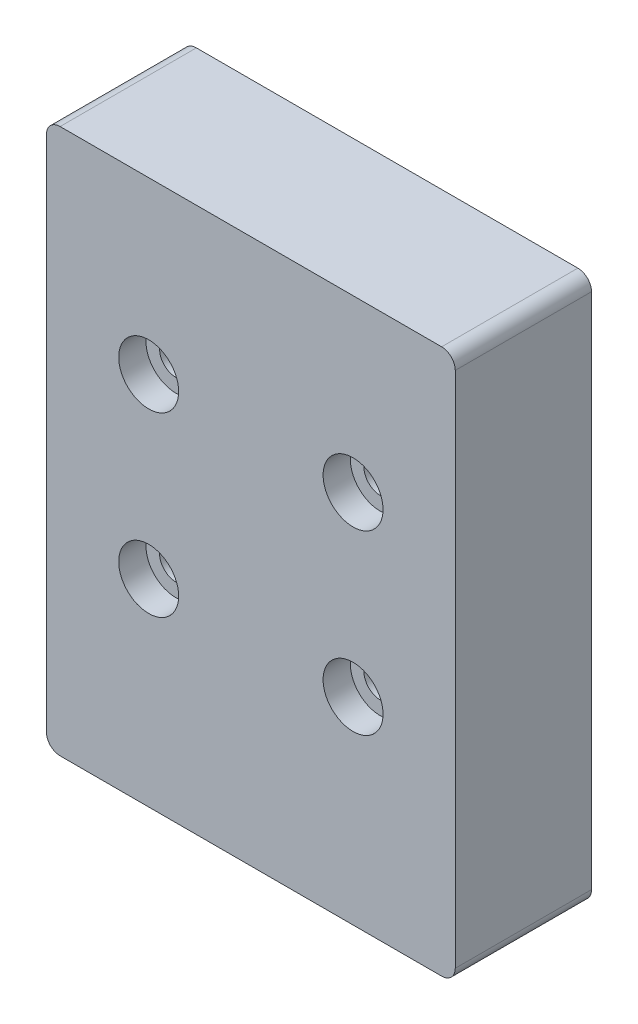
ISO-10303-21;
HEADER;
FILE_DESCRIPTION(('STEP AP214'),'2;1');
FILE_NAME('part.step','',(''),(''),'','','');
FILE_SCHEMA(('AUTOMOTIVE_DESIGN { 1 0 10303 214 1 1 1 1 }'));
ENDSEC;
DATA;
#1=APPLICATION_CONTEXT('core data for automotive mechanical design processes');
#2=APPLICATION_PROTOCOL_DEFINITION('international standard','automotive_design',2000,#1);
#3=PRODUCT_CONTEXT('',#1,'mechanical');
#4=PRODUCT('Part','Part','',(#3));
#5=PRODUCT_RELATED_PRODUCT_CATEGORY('part','',(#4));
#6=PRODUCT_DEFINITION_FORMATION('','',#4);
#7=PRODUCT_DEFINITION_CONTEXT('part definition',#1,'design');
#8=PRODUCT_DEFINITION('design','',#6,#7);
#9=PRODUCT_DEFINITION_SHAPE('','',#8);
#10=(LENGTH_UNIT() NAMED_UNIT(*) SI_UNIT(.MILLI.,.METRE.));
#11=(NAMED_UNIT(*) PLANE_ANGLE_UNIT() SI_UNIT($,.RADIAN.));
#12=(NAMED_UNIT(*) SI_UNIT($,.STERADIAN.) SOLID_ANGLE_UNIT());
#13=UNCERTAINTY_MEASURE_WITH_UNIT(LENGTH_MEASURE(1.E-05),#10,'distance_accuracy_value','');
#14=(GEOMETRIC_REPRESENTATION_CONTEXT(3) GLOBAL_UNCERTAINTY_ASSIGNED_CONTEXT((#13)) GLOBAL_UNIT_ASSIGNED_CONTEXT((#10,
#11,#12)) REPRESENTATION_CONTEXT('',''));
#15=CARTESIAN_POINT('',(0.,0.,0.));
#16=DIRECTION('',(0.,0.,1.));
#17=DIRECTION('',(1.,0.,0.));
#18=AXIS2_PLACEMENT_3D('',#15,#16,#17);
#19=CARTESIAN_POINT('',(15.,-20.,5.));
#20=DIRECTION('',(-1.,0.,0.));
#21=DIRECTION('',(0.,0.,1.));
#22=AXIS2_PLACEMENT_3D('',#19,#20,#21);
#23=PLANE('',#22);
#24=DIRECTION('',(0.,1.,0.));
#25=VECTOR('',#24,1.);
#26=CARTESIAN_POINT('',(15.,-20.,-5.));
#27=LINE('',#26,#25);
#28=CARTESIAN_POINT('',(15.,-19.,-5.));
#29=VERTEX_POINT('',#28);
#30=CARTESIAN_POINT('',(15.,19.,-5.));
#31=VERTEX_POINT('',#30);
#32=EDGE_CURVE('E126',#29,#31,#27,.T.);
#33=ORIENTED_EDGE('',*,*,#32,.T.);
#34=DIRECTION('',(0.,0.,-1.));
#35=VECTOR('',#34,1.);
#36=CARTESIAN_POINT('',(15.,19.,5.));
#37=LINE('',#36,#35);
#38=CARTESIAN_POINT('',(15.,19.,5.));
#39=VERTEX_POINT('',#38);
#40=EDGE_CURVE('E104',#31,#39,#37,.F.);
#41=ORIENTED_EDGE('',*,*,#40,.T.);
#42=DIRECTION('',(0.,1.,0.));
#43=VECTOR('',#42,1.);
#44=CARTESIAN_POINT('',(15.,-20.,5.));
#45=LINE('',#44,#43);
#46=CARTESIAN_POINT('',(15.,-19.,5.));
#47=VERTEX_POINT('',#46);
#48=EDGE_CURVE('E136',#47,#39,#45,.T.);
#49=ORIENTED_EDGE('',*,*,#48,.F.);
#50=DIRECTION('',(0.,0.,-1.));
#51=VECTOR('',#50,1.);
#52=CARTESIAN_POINT('',(15.,-19.,5.));
#53=LINE('',#52,#51);
#54=EDGE_CURVE('E109',#47,#29,#53,.T.);
#55=ORIENTED_EDGE('',*,*,#54,.T.);
#56=EDGE_LOOP('',(#33,#41,#49,#55));
#57=FACE_BOUND('',#56,.T.);
#58=ADVANCED_FACE('F33',(#57),#23,.F.);
#59=CARTESIAN_POINT('',(-15.,20.,5.));
#60=DIRECTION('',(0.,-1.,0.));
#61=DIRECTION('',(0.,0.,-1.));
#62=AXIS2_PLACEMENT_3D('',#59,#60,#61);
#63=PLANE('',#62);
#64=DIRECTION('',(-1.,0.,0.));
#65=VECTOR('',#64,1.);
#66=CARTESIAN_POINT('',(-15.,20.,5.));
#67=LINE('',#66,#65);
#68=CARTESIAN_POINT('',(14.,20.,5.));
#69=VERTEX_POINT('',#68);
#70=CARTESIAN_POINT('',(-14.,20.,5.));
#71=VERTEX_POINT('',#70);
#72=EDGE_CURVE('E119',#69,#71,#67,.T.);
#73=ORIENTED_EDGE('',*,*,#72,.F.);
#74=DIRECTION('',(0.,0.,-1.));
#75=VECTOR('',#74,1.);
#76=CARTESIAN_POINT('',(14.,20.,5.));
#77=LINE('',#76,#75);
#78=CARTESIAN_POINT('',(14.,20.,-5.));
#79=VERTEX_POINT('',#78);
#80=EDGE_CURVE('E103',#69,#79,#77,.T.);
#81=ORIENTED_EDGE('',*,*,#80,.T.);
#82=DIRECTION('',(-1.,0.,0.));
#83=VECTOR('',#82,1.);
#84=CARTESIAN_POINT('',(-15.,20.,-5.));
#85=LINE('',#84,#83);
#86=CARTESIAN_POINT('',(-14.,20.,-5.));
#87=VERTEX_POINT('',#86);
#88=EDGE_CURVE('E116',#79,#87,#85,.T.);
#89=ORIENTED_EDGE('',*,*,#88,.T.);
#90=DIRECTION('',(0.,0.,-1.));
#91=VECTOR('',#90,1.);
#92=CARTESIAN_POINT('',(-14.,20.,5.));
#93=LINE('',#92,#91);
#94=EDGE_CURVE('E121',#87,#71,#93,.F.);
#95=ORIENTED_EDGE('',*,*,#94,.T.);
#96=EDGE_LOOP('',(#73,#81,#89,#95));
#97=FACE_BOUND('',#96,.T.);
#98=ADVANCED_FACE('F115',(#97),#63,.F.);
#99=CARTESIAN_POINT('',(-15.,-20.,5.));
#100=DIRECTION('',(1.,0.,0.));
#101=DIRECTION('',(0.,0.,-1.));
#102=AXIS2_PLACEMENT_3D('',#99,#100,#101);
#103=PLANE('',#102);
#104=DIRECTION('',(0.,-1.,0.));
#105=VECTOR('',#104,1.);
#106=CARTESIAN_POINT('',(-15.,-20.,-5.));
#107=LINE('',#106,#105);
#108=CARTESIAN_POINT('',(-15.,19.,-5.));
#109=VERTEX_POINT('',#108);
#110=CARTESIAN_POINT('',(-15.,-19.,-5.));
#111=VERTEX_POINT('',#110);
#112=EDGE_CURVE('E125',#109,#111,#107,.T.);
#113=ORIENTED_EDGE('',*,*,#112,.T.);
#114=DIRECTION('',(0.,0.,-1.));
#115=VECTOR('',#114,1.);
#116=CARTESIAN_POINT('',(-15.,-19.,5.));
#117=LINE('',#116,#115);
#118=CARTESIAN_POINT('',(-15.,-19.,5.));
#119=VERTEX_POINT('',#118);
#120=EDGE_CURVE('E11',#111,#119,#117,.F.);
#121=ORIENTED_EDGE('',*,*,#120,.T.);
#122=DIRECTION('',(0.,-1.,0.));
#123=VECTOR('',#122,1.);
#124=CARTESIAN_POINT('',(-15.,-20.,5.));
#125=LINE('',#124,#123);
#126=CARTESIAN_POINT('',(-15.,19.,5.));
#127=VERTEX_POINT('',#126);
#128=EDGE_CURVE('E162',#127,#119,#125,.T.);
#129=ORIENTED_EDGE('',*,*,#128,.F.);
#130=DIRECTION('',(0.,0.,-1.));
#131=VECTOR('',#130,1.);
#132=CARTESIAN_POINT('',(-15.,19.,5.));
#133=LINE('',#132,#131);
#134=EDGE_CURVE('E41',#127,#109,#133,.T.);
#135=ORIENTED_EDGE('',*,*,#134,.T.);
#136=EDGE_LOOP('',(#113,#121,#129,#135));
#137=FACE_BOUND('',#136,.T.);
#138=ADVANCED_FACE('F160',(#137),#103,.F.);
#139=CARTESIAN_POINT('',(-15.,-20.,5.));
#140=DIRECTION('',(0.,1.,0.));
#141=DIRECTION('',(0.,0.,1.));
#142=AXIS2_PLACEMENT_3D('',#139,#140,#141);
#143=PLANE('',#142);
#144=DIRECTION('',(1.,0.,0.));
#145=VECTOR('',#144,1.);
#146=CARTESIAN_POINT('',(-15.,-20.,-5.));
#147=LINE('',#146,#145);
#148=CARTESIAN_POINT('',(-14.,-20.,-5.));
#149=VERTEX_POINT('',#148);
#150=CARTESIAN_POINT('',(14.,-20.,-5.));
#151=VERTEX_POINT('',#150);
#152=EDGE_CURVE('E129',#149,#151,#147,.T.);
#153=ORIENTED_EDGE('',*,*,#152,.T.);
#154=DIRECTION('',(0.,0.,-1.));
#155=VECTOR('',#154,1.);
#156=CARTESIAN_POINT('',(14.,-20.,5.));
#157=LINE('',#156,#155);
#158=CARTESIAN_POINT('',(14.,-20.,5.));
#159=VERTEX_POINT('',#158);
#160=EDGE_CURVE('E48',#151,#159,#157,.F.);
#161=ORIENTED_EDGE('',*,*,#160,.T.);
#162=DIRECTION('',(1.,0.,0.));
#163=VECTOR('',#162,1.);
#164=CARTESIAN_POINT('',(-15.,-20.,5.));
#165=LINE('',#164,#163);
#166=CARTESIAN_POINT('',(-14.,-20.,5.));
#167=VERTEX_POINT('',#166);
#168=EDGE_CURVE('E137',#167,#159,#165,.T.);
#169=ORIENTED_EDGE('',*,*,#168,.F.);
#170=DIRECTION('',(0.,0.,-1.));
#171=VECTOR('',#170,1.);
#172=CARTESIAN_POINT('',(-14.,-20.,5.));
#173=LINE('',#172,#171);
#174=EDGE_CURVE('E153',#167,#149,#173,.T.);
#175=ORIENTED_EDGE('',*,*,#174,.T.);
#176=EDGE_LOOP('',(#153,#161,#169,#175));
#177=FACE_BOUND('',#176,.T.);
#178=ADVANCED_FACE('F169',(#177),#143,.F.);
#179=CARTESIAN_POINT('',(0.,0.,5.));
#180=DIRECTION('',(0.,0.,-1.));
#181=DIRECTION('',(-1.,0.,0.));
#182=AXIS2_PLACEMENT_3D('',#179,#180,#181);
#183=PLANE('',#182);
#184=CARTESIAN_POINT('',(7.5,-5.5,5.));
#185=DIRECTION('',(0.,0.,1.));
#186=DIRECTION('',(1.,0.,0.));
#187=AXIS2_PLACEMENT_3D('',#184,#185,#186);
#188=CIRCLE('',#187,2.2);
#189=CARTESIAN_POINT('',(9.7,-5.5,5.));
#190=VERTEX_POINT('',#189);
#191=EDGE_CURVE('E220',#190,#190,#188,.T.);
#192=ORIENTED_EDGE('',*,*,#191,.F.);
#193=EDGE_LOOP('',(#192));
#194=FACE_BOUND('',#193,.T.);
#195=CARTESIAN_POINT('',(-7.5,-5.5,5.));
#196=DIRECTION('',(0.,0.,1.));
#197=DIRECTION('',(1.,0.,0.));
#198=AXIS2_PLACEMENT_3D('',#195,#196,#197);
#199=CIRCLE('',#198,2.2);
#200=CARTESIAN_POINT('',(-5.3,-5.5,5.));
#201=VERTEX_POINT('',#200);
#202=EDGE_CURVE('E208',#201,#201,#199,.T.);
#203=ORIENTED_EDGE('',*,*,#202,.F.);
#204=EDGE_LOOP('',(#203));
#205=FACE_BOUND('',#204,.T.);
#206=CARTESIAN_POINT('',(-7.5,7.5,5.));
#207=DIRECTION('',(0.,0.,1.));
#208=DIRECTION('',(1.,0.,0.));
#209=AXIS2_PLACEMENT_3D('',#206,#207,#208);
#210=CIRCLE('',#209,2.2);
#211=CARTESIAN_POINT('',(-5.3,7.5,5.));
#212=VERTEX_POINT('',#211);
#213=EDGE_CURVE('E196',#212,#212,#210,.T.);
#214=ORIENTED_EDGE('',*,*,#213,.F.);
#215=EDGE_LOOP('',(#214));
#216=FACE_BOUND('',#215,.T.);
#217=CARTESIAN_POINT('',(7.5,7.5,5.));
#218=DIRECTION('',(0.,0.,1.));
#219=DIRECTION('',(1.,0.,0.));
#220=AXIS2_PLACEMENT_3D('',#217,#218,#219);
#221=CIRCLE('',#220,2.2);
#222=CARTESIAN_POINT('',(9.7,7.5,5.));
#223=VERTEX_POINT('',#222);
#224=EDGE_CURVE('E184',#223,#223,#221,.T.);
#225=ORIENTED_EDGE('',*,*,#224,.F.);
#226=EDGE_LOOP('',(#225));
#227=FACE_BOUND('',#226,.T.);
#228=ORIENTED_EDGE('',*,*,#48,.T.);
#229=CARTESIAN_POINT('',(14.,19.,5.));
#230=DIRECTION('',(0.,0.,-1.));
#231=DIRECTION('',(-1.,0.,0.));
#232=AXIS2_PLACEMENT_3D('',#229,#230,#231);
#233=CIRCLE('',#232,1.);
#234=EDGE_CURVE('E151',#39,#69,#233,.F.);
#235=ORIENTED_EDGE('',*,*,#234,.T.);
#236=ORIENTED_EDGE('',*,*,#72,.T.);
#237=CARTESIAN_POINT('',(-14.,19.,5.));
#238=DIRECTION('',(0.,0.,-1.));
#239=DIRECTION('',(-1.,0.,0.));
#240=AXIS2_PLACEMENT_3D('',#237,#238,#239);
#241=CIRCLE('',#240,1.);
#242=EDGE_CURVE('E146',#71,#127,#241,.F.);
#243=ORIENTED_EDGE('',*,*,#242,.T.);
#244=ORIENTED_EDGE('',*,*,#128,.T.);
#245=CARTESIAN_POINT('',(-14.,-19.,5.));
#246=DIRECTION('',(0.,0.,-1.));
#247=DIRECTION('',(-1.,0.,0.));
#248=AXIS2_PLACEMENT_3D('',#245,#246,#247);
#249=CIRCLE('',#248,1.);
#250=EDGE_CURVE('E55',#119,#167,#249,.F.);
#251=ORIENTED_EDGE('',*,*,#250,.T.);
#252=ORIENTED_EDGE('',*,*,#168,.T.);
#253=CARTESIAN_POINT('',(14.,-19.,5.));
#254=DIRECTION('',(0.,0.,-1.));
#255=DIRECTION('',(-1.,0.,0.));
#256=AXIS2_PLACEMENT_3D('',#253,#254,#255);
#257=CIRCLE('',#256,1.);
#258=EDGE_CURVE('E149',#159,#47,#257,.F.);
#259=ORIENTED_EDGE('',*,*,#258,.T.);
#260=EDGE_LOOP('',(#228,#235,#236,#243,#244,#251,#252,#259));
#261=FACE_BOUND('',#260,.T.);
#262=ADVANCED_FACE('F226',(#194,#205,#216,#227,#261),#183,.F.);
#263=CARTESIAN_POINT('',(0.,0.,-5.));
#264=DIRECTION('',(0.,0.,-1.));
#265=DIRECTION('',(-1.,0.,0.));
#266=AXIS2_PLACEMENT_3D('',#263,#264,#265);
#267=PLANE('',#266);
#268=CARTESIAN_POINT('',(7.5,-5.5,-5.));
#269=DIRECTION('',(0.,0.,1.));
#270=DIRECTION('',(1.,0.,0.));
#271=AXIS2_PLACEMENT_3D('',#268,#269,#270);
#272=CIRCLE('',#271,1.2);
#273=CARTESIAN_POINT('',(8.7,-5.5,-5.));
#274=VERTEX_POINT('',#273);
#275=EDGE_CURVE('E217',#274,#274,#272,.T.);
#276=ORIENTED_EDGE('',*,*,#275,.T.);
#277=EDGE_LOOP('',(#276));
#278=FACE_BOUND('',#277,.T.);
#279=CARTESIAN_POINT('',(-7.5,-5.5,-5.));
#280=DIRECTION('',(0.,0.,1.));
#281=DIRECTION('',(1.,0.,0.));
#282=AXIS2_PLACEMENT_3D('',#279,#280,#281);
#283=CIRCLE('',#282,1.2);
#284=CARTESIAN_POINT('',(-6.3,-5.5,-5.));
#285=VERTEX_POINT('',#284);
#286=EDGE_CURVE('E205',#285,#285,#283,.T.);
#287=ORIENTED_EDGE('',*,*,#286,.T.);
#288=EDGE_LOOP('',(#287));
#289=FACE_BOUND('',#288,.T.);
#290=CARTESIAN_POINT('',(-7.5,7.5,-5.));
#291=DIRECTION('',(0.,0.,1.));
#292=DIRECTION('',(1.,0.,0.));
#293=AXIS2_PLACEMENT_3D('',#290,#291,#292);
#294=CIRCLE('',#293,1.2);
#295=CARTESIAN_POINT('',(-6.3,7.5,-5.));
#296=VERTEX_POINT('',#295);
#297=EDGE_CURVE('E187',#296,#296,#294,.T.);
#298=ORIENTED_EDGE('',*,*,#297,.T.);
#299=EDGE_LOOP('',(#298));
#300=FACE_BOUND('',#299,.T.);
#301=CARTESIAN_POINT('',(7.5,7.5,-5.));
#302=DIRECTION('',(0.,0.,1.));
#303=DIRECTION('',(1.,0.,0.));
#304=AXIS2_PLACEMENT_3D('',#301,#302,#303);
#305=CIRCLE('',#304,1.2);
#306=CARTESIAN_POINT('',(8.7,7.5,-5.));
#307=VERTEX_POINT('',#306);
#308=EDGE_CURVE('E131',#307,#307,#305,.T.);
#309=ORIENTED_EDGE('',*,*,#308,.T.);
#310=EDGE_LOOP('',(#309));
#311=FACE_BOUND('',#310,.T.);
#312=ORIENTED_EDGE('',*,*,#88,.F.);
#313=CARTESIAN_POINT('',(14.,19.,-5.));
#314=DIRECTION('',(0.,0.,-1.));
#315=DIRECTION('',(-1.,0.,0.));
#316=AXIS2_PLACEMENT_3D('',#313,#314,#315);
#317=CIRCLE('',#316,1.);
#318=EDGE_CURVE('E99',#79,#31,#317,.T.);
#319=ORIENTED_EDGE('',*,*,#318,.T.);
#320=ORIENTED_EDGE('',*,*,#32,.F.);
#321=CARTESIAN_POINT('',(14.,-19.,-5.));
#322=DIRECTION('',(0.,0.,-1.));
#323=DIRECTION('',(-1.,0.,0.));
#324=AXIS2_PLACEMENT_3D('',#321,#322,#323);
#325=CIRCLE('',#324,1.);
#326=EDGE_CURVE('E110',#29,#151,#325,.T.);
#327=ORIENTED_EDGE('',*,*,#326,.T.);
#328=ORIENTED_EDGE('',*,*,#152,.F.);
#329=CARTESIAN_POINT('',(-14.,-19.,-5.));
#330=DIRECTION('',(0.,0.,-1.));
#331=DIRECTION('',(-1.,0.,0.));
#332=AXIS2_PLACEMENT_3D('',#329,#330,#331);
#333=CIRCLE('',#332,1.);
#334=EDGE_CURVE('E140',#149,#111,#333,.T.);
#335=ORIENTED_EDGE('',*,*,#334,.T.);
#336=ORIENTED_EDGE('',*,*,#112,.F.);
#337=CARTESIAN_POINT('',(-14.,19.,-5.));
#338=DIRECTION('',(0.,0.,-1.));
#339=DIRECTION('',(-1.,0.,0.));
#340=AXIS2_PLACEMENT_3D('',#337,#338,#339);
#341=CIRCLE('',#340,1.);
#342=EDGE_CURVE('E120',#109,#87,#341,.T.);
#343=ORIENTED_EDGE('',*,*,#342,.T.);
#344=EDGE_LOOP('',(#312,#319,#320,#327,#328,#335,#336,#343));
#345=FACE_BOUND('',#344,.T.);
#346=ADVANCED_FACE('F123',(#278,#289,#300,#311,#345),#267,.T.);
#347=CARTESIAN_POINT('',(7.5,7.5,5.));
#348=DIRECTION('',(0.,0.,1.));
#349=DIRECTION('',(1.,0.,0.));
#350=AXIS2_PLACEMENT_3D('',#347,#348,#349);
#351=CYLINDRICAL_SURFACE('',#350,1.2);
#352=ORIENTED_EDGE('',*,*,#308,.F.);
#353=EDGE_LOOP('',(#352));
#354=FACE_BOUND('',#353,.T.);
#355=CARTESIAN_POINT('',(7.5,7.5,3.));
#356=DIRECTION('',(0.,0.,1.));
#357=DIRECTION('',(1.,0.,0.));
#358=AXIS2_PLACEMENT_3D('',#355,#356,#357);
#359=CIRCLE('',#358,1.2);
#360=CARTESIAN_POINT('',(8.7,7.5,3.));
#361=VERTEX_POINT('',#360);
#362=EDGE_CURVE('E178',#361,#361,#359,.T.);
#363=ORIENTED_EDGE('',*,*,#362,.T.);
#364=EDGE_LOOP('',(#363));
#365=FACE_BOUND('',#364,.T.);
#366=ADVANCED_FACE('F259',(#354,#365),#351,.F.);
#367=CARTESIAN_POINT('',(8.7,7.5,3.));
#368=DIRECTION('',(0.,0.,-1.));
#369=DIRECTION('',(-1.,0.,0.));
#370=AXIS2_PLACEMENT_3D('',#367,#368,#369);
#371=PLANE('',#370);
#372=ORIENTED_EDGE('',*,*,#362,.F.);
#373=EDGE_LOOP('',(#372));
#374=FACE_BOUND('',#373,.T.);
#375=CARTESIAN_POINT('',(7.5,7.5,3.));
#376=DIRECTION('',(0.,0.,1.));
#377=DIRECTION('',(1.,0.,0.));
#378=AXIS2_PLACEMENT_3D('',#375,#376,#377);
#379=CIRCLE('',#378,2.2);
#380=CARTESIAN_POINT('',(9.7,7.5,3.));
#381=VERTEX_POINT('',#380);
#382=EDGE_CURVE('E181',#381,#381,#379,.T.);
#383=ORIENTED_EDGE('',*,*,#382,.T.);
#384=EDGE_LOOP('',(#383));
#385=FACE_BOUND('',#384,.T.);
#386=ADVANCED_FACE('F264',(#374,#385),#371,.F.);
#387=CARTESIAN_POINT('',(7.5,7.5,5.));
#388=DIRECTION('',(0.,0.,1.));
#389=DIRECTION('',(1.,0.,0.));
#390=AXIS2_PLACEMENT_3D('',#387,#388,#389);
#391=CYLINDRICAL_SURFACE('',#390,2.2);
#392=ORIENTED_EDGE('',*,*,#382,.F.);
#393=EDGE_LOOP('',(#392));
#394=FACE_BOUND('',#393,.T.);
#395=ORIENTED_EDGE('',*,*,#224,.T.);
#396=EDGE_LOOP('',(#395));
#397=FACE_BOUND('',#396,.T.);
#398=ADVANCED_FACE('F268',(#394,#397),#391,.F.);
#399=CARTESIAN_POINT('',(-7.5,7.5,5.));
#400=DIRECTION('',(0.,0.,1.));
#401=DIRECTION('',(1.,0.,0.));
#402=AXIS2_PLACEMENT_3D('',#399,#400,#401);
#403=CYLINDRICAL_SURFACE('',#402,1.2);
#404=ORIENTED_EDGE('',*,*,#297,.F.);
#405=EDGE_LOOP('',(#404));
#406=FACE_BOUND('',#405,.T.);
#407=CARTESIAN_POINT('',(-7.5,7.5,3.));
#408=DIRECTION('',(0.,0.,1.));
#409=DIRECTION('',(1.,0.,0.));
#410=AXIS2_PLACEMENT_3D('',#407,#408,#409);
#411=CIRCLE('',#410,1.2);
#412=CARTESIAN_POINT('',(-6.3,7.5,3.));
#413=VERTEX_POINT('',#412);
#414=EDGE_CURVE('E190',#413,#413,#411,.T.);
#415=ORIENTED_EDGE('',*,*,#414,.T.);
#416=EDGE_LOOP('',(#415));
#417=FACE_BOUND('',#416,.T.);
#418=ADVANCED_FACE('F272',(#406,#417),#403,.F.);
#419=CARTESIAN_POINT('',(-6.3,7.5,3.));
#420=DIRECTION('',(0.,0.,-1.));
#421=DIRECTION('',(-1.,0.,0.));
#422=AXIS2_PLACEMENT_3D('',#419,#420,#421);
#423=PLANE('',#422);
#424=ORIENTED_EDGE('',*,*,#414,.F.);
#425=EDGE_LOOP('',(#424));
#426=FACE_BOUND('',#425,.T.);
#427=CARTESIAN_POINT('',(-7.5,7.5,3.));
#428=DIRECTION('',(0.,0.,1.));
#429=DIRECTION('',(1.,0.,0.));
#430=AXIS2_PLACEMENT_3D('',#427,#428,#429);
#431=CIRCLE('',#430,2.2);
#432=CARTESIAN_POINT('',(-5.3,7.5,3.));
#433=VERTEX_POINT('',#432);
#434=EDGE_CURVE('E193',#433,#433,#431,.T.);
#435=ORIENTED_EDGE('',*,*,#434,.T.);
#436=EDGE_LOOP('',(#435));
#437=FACE_BOUND('',#436,.T.);
#438=ADVANCED_FACE('F276',(#426,#437),#423,.F.);
#439=CARTESIAN_POINT('',(-7.5,7.5,5.));
#440=DIRECTION('',(0.,0.,1.));
#441=DIRECTION('',(1.,0.,0.));
#442=AXIS2_PLACEMENT_3D('',#439,#440,#441);
#443=CYLINDRICAL_SURFACE('',#442,2.2);
#444=ORIENTED_EDGE('',*,*,#434,.F.);
#445=EDGE_LOOP('',(#444));
#446=FACE_BOUND('',#445,.T.);
#447=ORIENTED_EDGE('',*,*,#213,.T.);
#448=EDGE_LOOP('',(#447));
#449=FACE_BOUND('',#448,.T.);
#450=ADVANCED_FACE('F280',(#446,#449),#443,.F.);
#451=CARTESIAN_POINT('',(-7.5,-5.5,5.));
#452=DIRECTION('',(0.,0.,1.));
#453=DIRECTION('',(1.,0.,0.));
#454=AXIS2_PLACEMENT_3D('',#451,#452,#453);
#455=CYLINDRICAL_SURFACE('',#454,1.2);
#456=ORIENTED_EDGE('',*,*,#286,.F.);
#457=EDGE_LOOP('',(#456));
#458=FACE_BOUND('',#457,.T.);
#459=CARTESIAN_POINT('',(-7.5,-5.5,3.));
#460=DIRECTION('',(0.,0.,1.));
#461=DIRECTION('',(1.,0.,0.));
#462=AXIS2_PLACEMENT_3D('',#459,#460,#461);
#463=CIRCLE('',#462,1.2);
#464=CARTESIAN_POINT('',(-6.3,-5.5,3.));
#465=VERTEX_POINT('',#464);
#466=EDGE_CURVE('E199',#465,#465,#463,.T.);
#467=ORIENTED_EDGE('',*,*,#466,.T.);
#468=EDGE_LOOP('',(#467));
#469=FACE_BOUND('',#468,.T.);
#470=ADVANCED_FACE('F284',(#458,#469),#455,.F.);
#471=CARTESIAN_POINT('',(-6.3,-5.5,3.));
#472=DIRECTION('',(0.,0.,-1.));
#473=DIRECTION('',(-1.,0.,0.));
#474=AXIS2_PLACEMENT_3D('',#471,#472,#473);
#475=PLANE('',#474);
#476=ORIENTED_EDGE('',*,*,#466,.F.);
#477=EDGE_LOOP('',(#476));
#478=FACE_BOUND('',#477,.T.);
#479=CARTESIAN_POINT('',(-7.5,-5.5,3.));
#480=DIRECTION('',(0.,0.,1.));
#481=DIRECTION('',(1.,0.,0.));
#482=AXIS2_PLACEMENT_3D('',#479,#480,#481);
#483=CIRCLE('',#482,2.2);
#484=CARTESIAN_POINT('',(-5.3,-5.5,3.));
#485=VERTEX_POINT('',#484);
#486=EDGE_CURVE('E202',#485,#485,#483,.T.);
#487=ORIENTED_EDGE('',*,*,#486,.T.);
#488=EDGE_LOOP('',(#487));
#489=FACE_BOUND('',#488,.T.);
#490=ADVANCED_FACE('F288',(#478,#489),#475,.F.);
#491=CARTESIAN_POINT('',(-7.5,-5.5,5.));
#492=DIRECTION('',(0.,0.,1.));
#493=DIRECTION('',(1.,0.,0.));
#494=AXIS2_PLACEMENT_3D('',#491,#492,#493);
#495=CYLINDRICAL_SURFACE('',#494,2.2);
#496=ORIENTED_EDGE('',*,*,#486,.F.);
#497=EDGE_LOOP('',(#496));
#498=FACE_BOUND('',#497,.T.);
#499=ORIENTED_EDGE('',*,*,#202,.T.);
#500=EDGE_LOOP('',(#499));
#501=FACE_BOUND('',#500,.T.);
#502=ADVANCED_FACE('F292',(#498,#501),#495,.F.);
#503=CARTESIAN_POINT('',(7.5,-5.5,5.));
#504=DIRECTION('',(0.,0.,1.));
#505=DIRECTION('',(1.,0.,0.));
#506=AXIS2_PLACEMENT_3D('',#503,#504,#505);
#507=CYLINDRICAL_SURFACE('',#506,1.2);
#508=ORIENTED_EDGE('',*,*,#275,.F.);
#509=EDGE_LOOP('',(#508));
#510=FACE_BOUND('',#509,.T.);
#511=CARTESIAN_POINT('',(7.5,-5.5,3.));
#512=DIRECTION('',(0.,0.,1.));
#513=DIRECTION('',(1.,0.,0.));
#514=AXIS2_PLACEMENT_3D('',#511,#512,#513);
#515=CIRCLE('',#514,1.2);
#516=CARTESIAN_POINT('',(8.7,-5.5,3.));
#517=VERTEX_POINT('',#516);
#518=EDGE_CURVE('E211',#517,#517,#515,.T.);
#519=ORIENTED_EDGE('',*,*,#518,.T.);
#520=EDGE_LOOP('',(#519));
#521=FACE_BOUND('',#520,.T.);
#522=ADVANCED_FACE('F296',(#510,#521),#507,.F.);
#523=CARTESIAN_POINT('',(8.7,-5.5,3.));
#524=DIRECTION('',(0.,0.,-1.));
#525=DIRECTION('',(-1.,0.,0.));
#526=AXIS2_PLACEMENT_3D('',#523,#524,#525);
#527=PLANE('',#526);
#528=ORIENTED_EDGE('',*,*,#518,.F.);
#529=EDGE_LOOP('',(#528));
#530=FACE_BOUND('',#529,.T.);
#531=CARTESIAN_POINT('',(7.5,-5.5,3.));
#532=DIRECTION('',(0.,0.,1.));
#533=DIRECTION('',(1.,0.,0.));
#534=AXIS2_PLACEMENT_3D('',#531,#532,#533);
#535=CIRCLE('',#534,2.2);
#536=CARTESIAN_POINT('',(9.7,-5.5,3.));
#537=VERTEX_POINT('',#536);
#538=EDGE_CURVE('E214',#537,#537,#535,.T.);
#539=ORIENTED_EDGE('',*,*,#538,.T.);
#540=EDGE_LOOP('',(#539));
#541=FACE_BOUND('',#540,.T.);
#542=ADVANCED_FACE('F300',(#530,#541),#527,.F.);
#543=CARTESIAN_POINT('',(7.5,-5.5,5.));
#544=DIRECTION('',(0.,0.,1.));
#545=DIRECTION('',(1.,0.,0.));
#546=AXIS2_PLACEMENT_3D('',#543,#544,#545);
#547=CYLINDRICAL_SURFACE('',#546,2.2);
#548=ORIENTED_EDGE('',*,*,#538,.F.);
#549=EDGE_LOOP('',(#548));
#550=FACE_BOUND('',#549,.T.);
#551=ORIENTED_EDGE('',*,*,#191,.T.);
#552=EDGE_LOOP('',(#551));
#553=FACE_BOUND('',#552,.T.);
#554=ADVANCED_FACE('F224',(#550,#553),#547,.F.);
#555=CARTESIAN_POINT('',(14.,19.,5.));
#556=DIRECTION('',(0.,0.,-1.));
#557=DIRECTION('',(-1.,0.,0.));
#558=AXIS2_PLACEMENT_3D('',#555,#556,#557);
#559=CYLINDRICAL_SURFACE('',#558,1.);
#560=ORIENTED_EDGE('',*,*,#234,.F.);
#561=ORIENTED_EDGE('',*,*,#40,.F.);
#562=ORIENTED_EDGE('',*,*,#318,.F.);
#563=ORIENTED_EDGE('',*,*,#80,.F.);
#564=EDGE_LOOP('',(#560,#561,#562,#563));
#565=FACE_BOUND('',#564,.T.);
#566=ADVANCED_FACE('F102',(#565),#559,.T.);
#567=CARTESIAN_POINT('',(14.,-19.,5.));
#568=DIRECTION('',(0.,0.,-1.));
#569=DIRECTION('',(-1.,0.,0.));
#570=AXIS2_PLACEMENT_3D('',#567,#568,#569);
#571=CYLINDRICAL_SURFACE('',#570,1.);
#572=ORIENTED_EDGE('',*,*,#258,.F.);
#573=ORIENTED_EDGE('',*,*,#160,.F.);
#574=ORIENTED_EDGE('',*,*,#326,.F.);
#575=ORIENTED_EDGE('',*,*,#54,.F.);
#576=EDGE_LOOP('',(#572,#573,#574,#575));
#577=FACE_BOUND('',#576,.T.);
#578=ADVANCED_FACE('F239',(#577),#571,.T.);
#579=CARTESIAN_POINT('',(-14.,-19.,5.));
#580=DIRECTION('',(0.,0.,-1.));
#581=DIRECTION('',(-1.,0.,0.));
#582=AXIS2_PLACEMENT_3D('',#579,#580,#581);
#583=CYLINDRICAL_SURFACE('',#582,1.);
#584=ORIENTED_EDGE('',*,*,#250,.F.);
#585=ORIENTED_EDGE('',*,*,#120,.F.);
#586=ORIENTED_EDGE('',*,*,#334,.F.);
#587=ORIENTED_EDGE('',*,*,#174,.F.);
#588=EDGE_LOOP('',(#584,#585,#586,#587));
#589=FACE_BOUND('',#588,.T.);
#590=ADVANCED_FACE('F168',(#589),#583,.T.);
#591=CARTESIAN_POINT('',(-14.,19.,5.));
#592=DIRECTION('',(0.,0.,-1.));
#593=DIRECTION('',(-1.,0.,0.));
#594=AXIS2_PLACEMENT_3D('',#591,#592,#593);
#595=CYLINDRICAL_SURFACE('',#594,1.);
#596=ORIENTED_EDGE('',*,*,#242,.F.);
#597=ORIENTED_EDGE('',*,*,#94,.F.);
#598=ORIENTED_EDGE('',*,*,#342,.F.);
#599=ORIENTED_EDGE('',*,*,#134,.F.);
#600=EDGE_LOOP('',(#596,#597,#598,#599));
#601=FACE_BOUND('',#600,.T.);
#602=ADVANCED_FACE('F35',(#601),#595,.T.);
#603=CLOSED_SHELL('',(#58,#98,#138,#178,#262,#346,#366,#386,#398,#418,#438,#450,#470,#490,#502,
#522,#542,#554,#566,#578,#590,#602));
#604=MANIFOLD_SOLID_BREP('B2',#603);
#605=ADVANCED_BREP_SHAPE_REPRESENTATION('',(#18,#604),#14);
#606=SHAPE_DEFINITION_REPRESENTATION(#9,#605);
ENDSEC;
END-ISO-10303-21;
